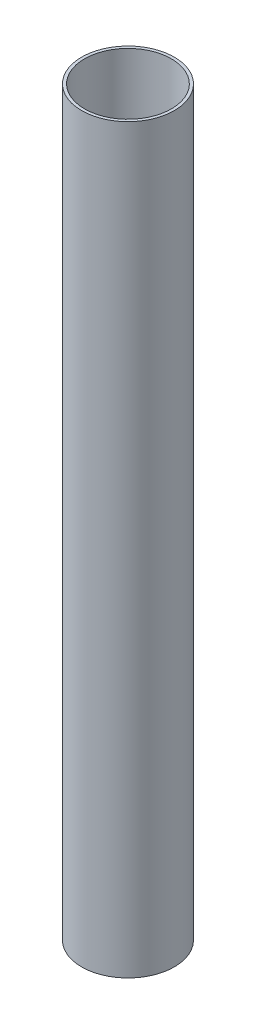
ISO-10303-21;
HEADER;
FILE_DESCRIPTION(('STEP AP214'),'2;1');
FILE_NAME('part.step','',(''),(''),'','','');
FILE_SCHEMA(('AUTOMOTIVE_DESIGN { 1 0 10303 214 1 1 1 1 }'));
ENDSEC;
DATA;
#1=APPLICATION_CONTEXT('core data for automotive mechanical design processes');
#2=APPLICATION_PROTOCOL_DEFINITION('international standard','automotive_design',2000,#1);
#3=PRODUCT_CONTEXT('',#1,'mechanical');
#4=PRODUCT('Part','Part','',(#3));
#5=PRODUCT_RELATED_PRODUCT_CATEGORY('part','',(#4));
#6=PRODUCT_DEFINITION_FORMATION('','',#4);
#7=PRODUCT_DEFINITION_CONTEXT('part definition',#1,'design');
#8=PRODUCT_DEFINITION('design','',#6,#7);
#9=PRODUCT_DEFINITION_SHAPE('','',#8);
#10=(LENGTH_UNIT() NAMED_UNIT(*) SI_UNIT(.MILLI.,.METRE.));
#11=(NAMED_UNIT(*) PLANE_ANGLE_UNIT() SI_UNIT($,.RADIAN.));
#12=(NAMED_UNIT(*) SI_UNIT($,.STERADIAN.) SOLID_ANGLE_UNIT());
#13=UNCERTAINTY_MEASURE_WITH_UNIT(LENGTH_MEASURE(1.E-05),#10,'distance_accuracy_value','');
#14=(GEOMETRIC_REPRESENTATION_CONTEXT(3) GLOBAL_UNCERTAINTY_ASSIGNED_CONTEXT((#13)) GLOBAL_UNIT_ASSIGNED_CONTEXT((#10,
#11,#12)) REPRESENTATION_CONTEXT('',''));
#15=CARTESIAN_POINT('',(0.,0.,0.));
#16=DIRECTION('',(0.,0.,1.));
#17=DIRECTION('',(1.,0.,0.));
#18=AXIS2_PLACEMENT_3D('',#15,#16,#17);
#19=CARTESIAN_POINT('',(0.,0.,0.));
#20=DIRECTION('',(0.,1.,0.));
#21=DIRECTION('',(0.,0.,1.));
#22=AXIS2_PLACEMENT_3D('',#19,#20,#21);
#23=CYLINDRICAL_SURFACE('',#22,6.35);
#24=CARTESIAN_POINT('',(0.,101.6,0.));
#25=DIRECTION('',(0.,1.,0.));
#26=DIRECTION('',(0.,0.,1.));
#27=AXIS2_PLACEMENT_3D('',#24,#25,#26);
#28=CIRCLE('',#27,6.35);
#29=CARTESIAN_POINT('',(0.,101.6,6.35));
#30=VERTEX_POINT('',#29);
#31=EDGE_CURVE('E51',#30,#30,#28,.T.);
#32=ORIENTED_EDGE('',*,*,#31,.F.);
#33=EDGE_LOOP('',(#32));
#34=FACE_BOUND('',#33,.T.);
#35=CARTESIAN_POINT('',(0.,0.,0.));
#36=DIRECTION('',(0.,1.,0.));
#37=DIRECTION('',(0.,0.,1.));
#38=AXIS2_PLACEMENT_3D('',#35,#36,#37);
#39=CIRCLE('',#38,6.35);
#40=CARTESIAN_POINT('',(0.,0.,6.35));
#41=VERTEX_POINT('',#40);
#42=EDGE_CURVE('E40',#41,#41,#39,.T.);
#43=ORIENTED_EDGE('',*,*,#42,.T.);
#44=EDGE_LOOP('',(#43));
#45=FACE_BOUND('',#44,.T.);
#46=ADVANCED_FACE('F37',(#34,#45),#23,.T.);
#47=CARTESIAN_POINT('',(0.,0.,0.));
#48=DIRECTION('',(0.,1.,0.));
#49=DIRECTION('',(0.,0.,1.));
#50=AXIS2_PLACEMENT_3D('',#47,#48,#49);
#51=PLANE('',#50);
#52=CARTESIAN_POINT('',(0.,0.,0.));
#53=DIRECTION('',(0.,1.,0.));
#54=DIRECTION('',(0.,0.,1.));
#55=AXIS2_PLACEMENT_3D('',#52,#53,#54);
#56=CIRCLE('',#55,5.94951948989766);
#57=CARTESIAN_POINT('',(0.,0.,5.94951948989766));
#58=VERTEX_POINT('',#57);
#59=EDGE_CURVE('E45',#58,#58,#56,.F.);
#60=ORIENTED_EDGE('',*,*,#59,.F.);
#61=EDGE_LOOP('',(#60));
#62=FACE_BOUND('',#61,.T.);
#63=ORIENTED_EDGE('',*,*,#42,.F.);
#64=EDGE_LOOP('',(#63));
#65=FACE_BOUND('',#64,.T.);
#66=ADVANCED_FACE('F62',(#62,#65),#51,.F.);
#67=CARTESIAN_POINT('',(0.,101.6,0.));
#68=DIRECTION('',(0.,1.,0.));
#69=DIRECTION('',(0.,0.,1.));
#70=AXIS2_PLACEMENT_3D('',#67,#68,#69);
#71=PLANE('',#70);
#72=CARTESIAN_POINT('',(0.,101.6,0.));
#73=DIRECTION('',(0.,1.,0.));
#74=DIRECTION('',(0.,0.,1.));
#75=AXIS2_PLACEMENT_3D('',#72,#73,#74);
#76=CIRCLE('',#75,5.94951948989766);
#77=CARTESIAN_POINT('',(0.,101.6,5.94951948989766));
#78=VERTEX_POINT('',#77);
#79=EDGE_CURVE('E10',#78,#78,#76,.F.);
#80=ORIENTED_EDGE('',*,*,#79,.T.);
#81=EDGE_LOOP('',(#80));
#82=FACE_BOUND('',#81,.T.);
#83=ORIENTED_EDGE('',*,*,#31,.T.);
#84=EDGE_LOOP('',(#83));
#85=FACE_BOUND('',#84,.T.);
#86=ADVANCED_FACE('F64',(#82,#85),#71,.T.);
#87=CARTESIAN_POINT('',(0.,0.,0.));
#88=DIRECTION('',(0.,1.,0.));
#89=DIRECTION('',(0.,0.,1.));
#90=AXIS2_PLACEMENT_3D('',#87,#88,#89);
#91=CYLINDRICAL_SURFACE('',#90,5.94951948989766);
#92=ORIENTED_EDGE('',*,*,#79,.F.);
#93=EDGE_LOOP('',(#92));
#94=FACE_BOUND('',#93,.T.);
#95=ORIENTED_EDGE('',*,*,#59,.T.);
#96=EDGE_LOOP('',(#95));
#97=FACE_BOUND('',#96,.T.);
#98=ADVANCED_FACE('F70',(#94,#97),#91,.F.);
#99=CLOSED_SHELL('',(#46,#66,#86,#98));
#100=MANIFOLD_SOLID_BREP('B2',#99);
#101=ADVANCED_BREP_SHAPE_REPRESENTATION('',(#18,#100),#14);
#102=SHAPE_DEFINITION_REPRESENTATION(#9,#101);
ENDSEC;
END-ISO-10303-21;
